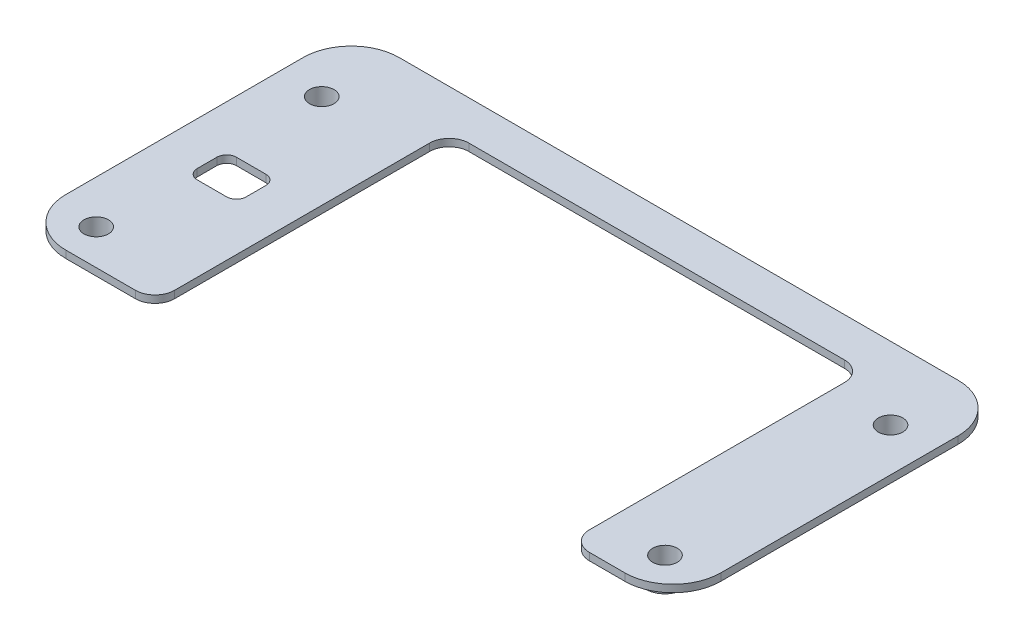
ISO-10303-21;
HEADER;
FILE_DESCRIPTION(('STEP AP214'),'2;1');
FILE_NAME('part.step','',(''),(''),'','','');
FILE_SCHEMA(('AUTOMOTIVE_DESIGN { 1 0 10303 214 1 1 1 1 }'));
ENDSEC;
DATA;
#1=APPLICATION_CONTEXT('core data for automotive mechanical design processes');
#2=APPLICATION_PROTOCOL_DEFINITION('international standard','automotive_design',2000,#1);
#3=PRODUCT_CONTEXT('',#1,'mechanical');
#4=PRODUCT('Part','Part','',(#3));
#5=PRODUCT_RELATED_PRODUCT_CATEGORY('part','',(#4));
#6=PRODUCT_DEFINITION_FORMATION('','',#4);
#7=PRODUCT_DEFINITION_CONTEXT('part definition',#1,'design');
#8=PRODUCT_DEFINITION('design','',#6,#7);
#9=PRODUCT_DEFINITION_SHAPE('','',#8);
#10=(LENGTH_UNIT() NAMED_UNIT(*) SI_UNIT(.MILLI.,.METRE.));
#11=(NAMED_UNIT(*) PLANE_ANGLE_UNIT() SI_UNIT($,.RADIAN.));
#12=(NAMED_UNIT(*) SI_UNIT($,.STERADIAN.) SOLID_ANGLE_UNIT());
#13=UNCERTAINTY_MEASURE_WITH_UNIT(LENGTH_MEASURE(1.E-05),#10,'distance_accuracy_value','');
#14=(GEOMETRIC_REPRESENTATION_CONTEXT(3) GLOBAL_UNCERTAINTY_ASSIGNED_CONTEXT((#13)) GLOBAL_UNIT_ASSIGNED_CONTEXT((#10,
#11,#12)) REPRESENTATION_CONTEXT('',''));
#15=CARTESIAN_POINT('',(0.,0.,0.));
#16=DIRECTION('',(0.,0.,1.));
#17=DIRECTION('',(1.,0.,0.));
#18=AXIS2_PLACEMENT_3D('',#15,#16,#17);
#19=CARTESIAN_POINT('',(20.2165568050337,0.75,15.665));
#20=DIRECTION('',(0.,0.,-1.));
#21=DIRECTION('',(-1.,0.,0.));
#22=AXIS2_PLACEMENT_3D('',#19,#20,#21);
#23=PLANE('',#22);
#24=DIRECTION('',(1.,0.,0.));
#25=VECTOR('',#24,1.);
#26=CARTESIAN_POINT('',(20.2165568050337,0.,15.665));
#27=LINE('',#26,#25);
#28=CARTESIAN_POINT('',(-28.2834431949663,0.,15.665));
#29=VERTEX_POINT('',#28);
#30=CARTESIAN_POINT('',(-21.1834431949663,0.,15.665));
#31=VERTEX_POINT('',#30);
#32=EDGE_CURVE('E346',#29,#31,#27,.T.);
#33=ORIENTED_EDGE('',*,*,#32,.T.);
#34=DIRECTION('',(0.,1.,0.));
#35=VECTOR('',#34,1.);
#36=CARTESIAN_POINT('',(-21.1834431949663,0.75,15.665));
#37=LINE('',#36,#35);
#38=CARTESIAN_POINT('',(-21.1834431949663,0.75,15.665));
#39=VERTEX_POINT('',#38);
#40=EDGE_CURVE('E421',#31,#39,#37,.T.);
#41=ORIENTED_EDGE('',*,*,#40,.T.);
#42=DIRECTION('',(1.,0.,0.));
#43=VECTOR('',#42,1.);
#44=CARTESIAN_POINT('',(-28.2834431949663,0.75,15.665));
#45=LINE('',#44,#43);
#46=CARTESIAN_POINT('',(-28.2834431949663,0.75,15.665));
#47=VERTEX_POINT('',#46);
#48=EDGE_CURVE('E326',#47,#39,#45,.T.);
#49=ORIENTED_EDGE('',*,*,#48,.F.);
#50=DIRECTION('',(0.,-1.,0.));
#51=VECTOR('',#50,1.);
#52=CARTESIAN_POINT('',(-28.2834431949663,0.75,15.665));
#53=LINE('',#52,#51);
#54=EDGE_CURVE('E360',#47,#29,#53,.T.);
#55=ORIENTED_EDGE('',*,*,#54,.T.);
#56=EDGE_LOOP('',(#33,#41,#49,#55));
#57=FACE_BOUND('',#56,.T.);
#58=ADVANCED_FACE('F39',(#57),#23,.F.);
#59=CARTESIAN_POINT('',(28.7165568050337,0.75,-13.435));
#60=DIRECTION('',(0.,-1.,0.));
#61=DIRECTION('',(0.,0.,-1.));
#62=AXIS2_PLACEMENT_3D('',#59,#60,#61);
#63=CYLINDRICAL_SURFACE('',#62,4.9);
#64=CARTESIAN_POINT('',(28.7165568050337,0.,-13.435));
#65=DIRECTION('',(0.,1.,0.));
#66=DIRECTION('',(0.,0.,1.));
#67=AXIS2_PLACEMENT_3D('',#64,#65,#66);
#68=CIRCLE('',#67,4.9);
#69=CARTESIAN_POINT('',(33.6165568050337,0.,-13.435));
#70=VERTEX_POINT('',#69);
#71=CARTESIAN_POINT('',(28.7165568050337,0.,-18.335));
#72=VERTEX_POINT('',#71);
#73=EDGE_CURVE('E312',#70,#72,#68,.T.);
#74=ORIENTED_EDGE('',*,*,#73,.T.);
#75=DIRECTION('',(0.,-1.,0.));
#76=VECTOR('',#75,1.);
#77=CARTESIAN_POINT('',(28.7165568050337,0.75,-18.335));
#78=LINE('',#77,#76);
#79=CARTESIAN_POINT('',(28.7165568050337,0.75,-18.335));
#80=VERTEX_POINT('',#79);
#81=EDGE_CURVE('E372',#80,#72,#78,.T.);
#82=ORIENTED_EDGE('',*,*,#81,.F.);
#83=CARTESIAN_POINT('',(28.7165568050337,0.75,-13.435));
#84=DIRECTION('',(0.,1.,0.));
#85=DIRECTION('',(0.,0.,1.));
#86=AXIS2_PLACEMENT_3D('',#83,#84,#85);
#87=CIRCLE('',#86,4.9);
#88=CARTESIAN_POINT('',(33.6165568050337,0.75,-13.435));
#89=VERTEX_POINT('',#88);
#90=EDGE_CURVE('E313',#89,#80,#87,.T.);
#91=ORIENTED_EDGE('',*,*,#90,.F.);
#92=DIRECTION('',(0.,-1.,0.));
#93=VECTOR('',#92,1.);
#94=CARTESIAN_POINT('',(33.6165568050337,0.75,-13.435));
#95=LINE('',#94,#93);
#96=EDGE_CURVE('E333',#89,#70,#95,.T.);
#97=ORIENTED_EDGE('',*,*,#96,.T.);
#98=EDGE_LOOP('',(#74,#82,#91,#97));
#99=FACE_BOUND('',#98,.T.);
#100=ADVANCED_FACE('F475',(#99),#63,.T.);
#101=CARTESIAN_POINT('',(-28.2834431949663,0.75,-18.335));
#102=DIRECTION('',(0.,0.,1.));
#103=DIRECTION('',(1.,0.,0.));
#104=AXIS2_PLACEMENT_3D('',#101,#102,#103);
#105=PLANE('',#104);
#106=DIRECTION('',(-1.,0.,0.));
#107=VECTOR('',#106,1.);
#108=CARTESIAN_POINT('',(-28.2834431949663,0.,-18.335));
#109=LINE('',#108,#107);
#110=CARTESIAN_POINT('',(-28.2834431949663,0.,-18.335));
#111=VERTEX_POINT('',#110);
#112=EDGE_CURVE('E336',#72,#111,#109,.T.);
#113=ORIENTED_EDGE('',*,*,#112,.T.);
#114=DIRECTION('',(0.,-1.,0.));
#115=VECTOR('',#114,1.);
#116=CARTESIAN_POINT('',(-28.2834431949663,0.75,-18.335));
#117=LINE('',#116,#115);
#118=CARTESIAN_POINT('',(-28.2834431949663,0.75,-18.335));
#119=VERTEX_POINT('',#118);
#120=EDGE_CURVE('E369',#119,#111,#117,.T.);
#121=ORIENTED_EDGE('',*,*,#120,.F.);
#122=DIRECTION('',(-1.,0.,0.));
#123=VECTOR('',#122,1.);
#124=CARTESIAN_POINT('',(-28.2834431949663,0.75,-18.335));
#125=LINE('',#124,#123);
#126=EDGE_CURVE('E316',#80,#119,#125,.T.);
#127=ORIENTED_EDGE('',*,*,#126,.F.);
#128=ORIENTED_EDGE('',*,*,#81,.T.);
#129=EDGE_LOOP('',(#113,#121,#127,#128));
#130=FACE_BOUND('',#129,.T.);
#131=ADVANCED_FACE('F469',(#130),#105,.F.);
#132=CARTESIAN_POINT('',(-28.2834431949663,0.75,-13.435));
#133=DIRECTION('',(0.,-1.,0.));
#134=DIRECTION('',(0.,0.,-1.));
#135=AXIS2_PLACEMENT_3D('',#132,#133,#134);
#136=CYLINDRICAL_SURFACE('',#135,4.9);
#137=CARTESIAN_POINT('',(-28.2834431949663,0.,-13.435));
#138=DIRECTION('',(0.,1.,0.));
#139=DIRECTION('',(0.,0.,-1.));
#140=AXIS2_PLACEMENT_3D('',#137,#138,#139);
#141=CIRCLE('',#140,4.9);
#142=CARTESIAN_POINT('',(-33.1834431949663,0.,-13.435));
#143=VERTEX_POINT('',#142);
#144=EDGE_CURVE('E338',#111,#143,#141,.T.);
#145=ORIENTED_EDGE('',*,*,#144,.T.);
#146=DIRECTION('',(0.,-1.,0.));
#147=VECTOR('',#146,1.);
#148=CARTESIAN_POINT('',(-33.1834431949663,0.75,-13.435));
#149=LINE('',#148,#147);
#150=CARTESIAN_POINT('',(-33.1834431949663,0.75,-13.435));
#151=VERTEX_POINT('',#150);
#152=EDGE_CURVE('E366',#151,#143,#149,.T.);
#153=ORIENTED_EDGE('',*,*,#152,.F.);
#154=CARTESIAN_POINT('',(-28.2834431949663,0.75,-13.435));
#155=DIRECTION('',(0.,1.,0.));
#156=DIRECTION('',(0.,0.,-1.));
#157=AXIS2_PLACEMENT_3D('',#154,#155,#156);
#158=CIRCLE('',#157,4.9);
#159=EDGE_CURVE('E319',#119,#151,#158,.T.);
#160=ORIENTED_EDGE('',*,*,#159,.F.);
#161=ORIENTED_EDGE('',*,*,#120,.T.);
#162=EDGE_LOOP('',(#145,#153,#160,#161));
#163=FACE_BOUND('',#162,.T.);
#164=ADVANCED_FACE('F466',(#163),#136,.T.);
#165=CARTESIAN_POINT('',(-33.1834431949663,0.75,-13.435));
#166=DIRECTION('',(1.,0.,0.));
#167=DIRECTION('',(0.,0.,-1.));
#168=AXIS2_PLACEMENT_3D('',#165,#166,#167);
#169=PLANE('',#168);
#170=DIRECTION('',(0.,0.,1.));
#171=VECTOR('',#170,1.);
#172=CARTESIAN_POINT('',(-33.1834431949663,0.,-13.435));
#173=LINE('',#172,#171);
#174=CARTESIAN_POINT('',(-33.1834431949663,0.,10.765));
#175=VERTEX_POINT('',#174);
#176=EDGE_CURVE('E340',#143,#175,#173,.T.);
#177=ORIENTED_EDGE('',*,*,#176,.T.);
#178=DIRECTION('',(0.,-1.,0.));
#179=VECTOR('',#178,1.);
#180=CARTESIAN_POINT('',(-33.1834431949663,0.75,10.765));
#181=LINE('',#180,#179);
#182=CARTESIAN_POINT('',(-33.1834431949663,0.75,10.765));
#183=VERTEX_POINT('',#182);
#184=EDGE_CURVE('E363',#183,#175,#181,.T.);
#185=ORIENTED_EDGE('',*,*,#184,.F.);
#186=DIRECTION('',(0.,0.,1.));
#187=VECTOR('',#186,1.);
#188=CARTESIAN_POINT('',(-33.1834431949663,0.75,-13.435));
#189=LINE('',#188,#187);
#190=EDGE_CURVE('E321',#151,#183,#189,.T.);
#191=ORIENTED_EDGE('',*,*,#190,.F.);
#192=ORIENTED_EDGE('',*,*,#152,.T.);
#193=EDGE_LOOP('',(#177,#185,#191,#192));
#194=FACE_BOUND('',#193,.T.);
#195=ADVANCED_FACE('F461',(#194),#169,.F.);
#196=CARTESIAN_POINT('',(-28.2834431949663,0.75,10.765));
#197=DIRECTION('',(0.,-1.,0.));
#198=DIRECTION('',(0.,0.,-1.));
#199=AXIS2_PLACEMENT_3D('',#196,#197,#198);
#200=CYLINDRICAL_SURFACE('',#199,4.9);
#201=CARTESIAN_POINT('',(-28.2834431949663,0.,10.765));
#202=DIRECTION('',(0.,1.,0.));
#203=DIRECTION('',(0.,0.,1.));
#204=AXIS2_PLACEMENT_3D('',#201,#202,#203);
#205=CIRCLE('',#204,4.9);
#206=EDGE_CURVE('E342',#175,#29,#205,.T.);
#207=ORIENTED_EDGE('',*,*,#206,.T.);
#208=ORIENTED_EDGE('',*,*,#54,.F.);
#209=CARTESIAN_POINT('',(-28.2834431949663,0.75,10.765));
#210=DIRECTION('',(0.,1.,0.));
#211=DIRECTION('',(0.,0.,1.));
#212=AXIS2_PLACEMENT_3D('',#209,#210,#211);
#213=CIRCLE('',#212,4.9);
#214=EDGE_CURVE('E323',#183,#47,#213,.T.);
#215=ORIENTED_EDGE('',*,*,#214,.F.);
#216=ORIENTED_EDGE('',*,*,#184,.T.);
#217=EDGE_LOOP('',(#207,#208,#215,#216));
#218=FACE_BOUND('',#217,.T.);
#219=ADVANCED_FACE('F456',(#218),#200,.T.);
#220=CARTESIAN_POINT('',(25.1165568050337,0.75,15.665));
#221=VERTEX_POINT('',#220);
#222=CARTESIAN_POINT('',(28.7165568050337,0.75,15.665));
#223=VERTEX_POINT('',#222);
#224=EDGE_CURVE('E325',#221,#223,#45,.T.);
#225=ORIENTED_EDGE('',*,*,#224,.F.);
#226=DIRECTION('',(0.,1.,0.));
#227=VECTOR('',#226,1.);
#228=CARTESIAN_POINT('',(25.1165568050337,0.75,15.665));
#229=LINE('',#228,#227);
#230=CARTESIAN_POINT('',(25.1165568050337,0.,15.665));
#231=VERTEX_POINT('',#230);
#232=EDGE_CURVE('E405',#221,#231,#229,.F.);
#233=ORIENTED_EDGE('',*,*,#232,.T.);
#234=CARTESIAN_POINT('',(28.7165568050337,0.,15.665));
#235=VERTEX_POINT('',#234);
#236=EDGE_CURVE('E345',#231,#235,#27,.T.);
#237=ORIENTED_EDGE('',*,*,#236,.T.);
#238=DIRECTION('',(0.,-1.,0.));
#239=VECTOR('',#238,1.);
#240=CARTESIAN_POINT('',(28.7165568050337,0.75,15.665));
#241=LINE('',#240,#239);
#242=EDGE_CURVE('E357',#223,#235,#241,.T.);
#243=ORIENTED_EDGE('',*,*,#242,.F.);
#244=EDGE_LOOP('',(#225,#233,#237,#243));
#245=FACE_BOUND('',#244,.T.);
#246=ADVANCED_FACE('F509',(#245),#23,.F.);
#247=CARTESIAN_POINT('',(28.7165568050337,0.75,10.765));
#248=DIRECTION('',(0.,-1.,0.));
#249=DIRECTION('',(0.,0.,-1.));
#250=AXIS2_PLACEMENT_3D('',#247,#248,#249);
#251=CYLINDRICAL_SURFACE('',#250,4.9);
#252=CARTESIAN_POINT('',(28.7165568050337,0.,10.765));
#253=DIRECTION('',(0.,1.,0.));
#254=DIRECTION('',(0.,0.,1.));
#255=AXIS2_PLACEMENT_3D('',#252,#253,#254);
#256=CIRCLE('',#255,4.9);
#257=CARTESIAN_POINT('',(33.6165568050337,0.,10.765));
#258=VERTEX_POINT('',#257);
#259=EDGE_CURVE('E349',#235,#258,#256,.T.);
#260=ORIENTED_EDGE('',*,*,#259,.T.);
#261=DIRECTION('',(0.,-1.,0.));
#262=VECTOR('',#261,1.);
#263=CARTESIAN_POINT('',(33.6165568050337,0.75,10.765));
#264=LINE('',#263,#262);
#265=CARTESIAN_POINT('',(33.6165568050337,0.75,10.765));
#266=VERTEX_POINT('',#265);
#267=EDGE_CURVE('E354',#266,#258,#264,.T.);
#268=ORIENTED_EDGE('',*,*,#267,.F.);
#269=CARTESIAN_POINT('',(28.7165568050337,0.75,10.765));
#270=DIRECTION('',(0.,1.,0.));
#271=DIRECTION('',(0.,0.,1.));
#272=AXIS2_PLACEMENT_3D('',#269,#270,#271);
#273=CIRCLE('',#272,4.9);
#274=EDGE_CURVE('E329',#223,#266,#273,.T.);
#275=ORIENTED_EDGE('',*,*,#274,.F.);
#276=ORIENTED_EDGE('',*,*,#242,.T.);
#277=EDGE_LOOP('',(#260,#268,#275,#276));
#278=FACE_BOUND('',#277,.T.);
#279=ADVANCED_FACE('F484',(#278),#251,.T.);
#280=CARTESIAN_POINT('',(33.6165568050337,0.75,10.765));
#281=DIRECTION('',(-1.,0.,0.));
#282=DIRECTION('',(0.,0.,1.));
#283=AXIS2_PLACEMENT_3D('',#280,#281,#282);
#284=PLANE('',#283);
#285=DIRECTION('',(0.,0.,-1.));
#286=VECTOR('',#285,1.);
#287=CARTESIAN_POINT('',(33.6165568050337,0.,10.765));
#288=LINE('',#287,#286);
#289=EDGE_CURVE('E317',#258,#70,#288,.T.);
#290=ORIENTED_EDGE('',*,*,#289,.T.);
#291=ORIENTED_EDGE('',*,*,#96,.F.);
#292=DIRECTION('',(0.,0.,-1.));
#293=VECTOR('',#292,1.);
#294=CARTESIAN_POINT('',(33.6165568050337,0.75,10.765));
#295=LINE('',#294,#293);
#296=EDGE_CURVE('E331',#266,#89,#295,.T.);
#297=ORIENTED_EDGE('',*,*,#296,.F.);
#298=ORIENTED_EDGE('',*,*,#267,.T.);
#299=EDGE_LOOP('',(#290,#291,#297,#298));
#300=FACE_BOUND('',#299,.T.);
#301=ADVANCED_FACE('F480',(#300),#284,.F.);
#302=CARTESIAN_POINT('',(28.7165568050337,0.75,-13.435));
#303=DIRECTION('',(0.,1.,0.));
#304=DIRECTION('',(0.,0.,1.));
#305=AXIS2_PLACEMENT_3D('',#302,#303,#304);
#306=PLANE('',#305);
#307=CARTESIAN_POINT('',(-24.7834431949663,0.75,1.765));
#308=DIRECTION('',(0.,-1.,0.));
#309=DIRECTION('',(0.,0.,1.));
#310=AXIS2_PLACEMENT_3D('',#307,#308,#309);
#311=CIRCLE('',#310,1.);
#312=CARTESIAN_POINT('',(-23.7834431949663,0.75,1.76499999999999));
#313=VERTEX_POINT('',#312);
#314=CARTESIAN_POINT('',(-24.7834431949663,0.75,2.765));
#315=VERTEX_POINT('',#314);
#316=EDGE_CURVE('E201',#313,#315,#311,.T.);
#317=ORIENTED_EDGE('',*,*,#316,.T.);
#318=DIRECTION('',(-1.,0.,0.));
#319=VECTOR('',#318,1.);
#320=CARTESIAN_POINT('',(-27.7834431949663,0.75,2.765));
#321=LINE('',#320,#319);
#322=CARTESIAN_POINT('',(-27.7834431949663,0.75,2.765));
#323=VERTEX_POINT('',#322);
#324=EDGE_CURVE('E210',#315,#323,#321,.T.);
#325=ORIENTED_EDGE('',*,*,#324,.T.);
#326=CARTESIAN_POINT('',(-27.7834431949663,0.75,1.765));
#327=DIRECTION('',(0.,-1.,0.));
#328=DIRECTION('',(0.,0.,-1.));
#329=AXIS2_PLACEMENT_3D('',#326,#327,#328);
#330=CIRCLE('',#329,1.);
#331=CARTESIAN_POINT('',(-28.7834431949663,0.75,1.76499999999999));
#332=VERTEX_POINT('',#331);
#333=EDGE_CURVE('E54',#323,#332,#330,.T.);
#334=ORIENTED_EDGE('',*,*,#333,.T.);
#335=DIRECTION('',(0.,0.,-1.));
#336=VECTOR('',#335,1.);
#337=CARTESIAN_POINT('',(-28.7834431949663,0.75,1.76499999999999));
#338=LINE('',#337,#336);
#339=CARTESIAN_POINT('',(-28.7834431949663,0.75,-0.234999999999995));
#340=VERTEX_POINT('',#339);
#341=EDGE_CURVE('E225',#332,#340,#338,.T.);
#342=ORIENTED_EDGE('',*,*,#341,.T.);
#343=CARTESIAN_POINT('',(-27.7834431949663,0.75,-0.235000000000002));
#344=DIRECTION('',(0.,-1.,0.));
#345=DIRECTION('',(0.,0.,-1.));
#346=AXIS2_PLACEMENT_3D('',#343,#344,#345);
#347=CIRCLE('',#346,1.);
#348=CARTESIAN_POINT('',(-27.7834431949663,0.75,-1.235));
#349=VERTEX_POINT('',#348);
#350=EDGE_CURVE('E228',#340,#349,#347,.T.);
#351=ORIENTED_EDGE('',*,*,#350,.T.);
#352=DIRECTION('',(1.,0.,0.));
#353=VECTOR('',#352,1.);
#354=CARTESIAN_POINT('',(-27.7834431949663,0.75,-1.235));
#355=LINE('',#354,#353);
#356=CARTESIAN_POINT('',(-24.7834431949663,0.75,-1.235));
#357=VERTEX_POINT('',#356);
#358=EDGE_CURVE('E231',#349,#357,#355,.T.);
#359=ORIENTED_EDGE('',*,*,#358,.T.);
#360=CARTESIAN_POINT('',(-24.7834431949663,0.75,-0.235000000000002));
#361=DIRECTION('',(0.,-1.,0.));
#362=DIRECTION('',(0.,0.,-1.));
#363=AXIS2_PLACEMENT_3D('',#360,#361,#362);
#364=CIRCLE('',#363,1.);
#365=CARTESIAN_POINT('',(-23.7834431949663,0.75,-0.234999999999995));
#366=VERTEX_POINT('',#365);
#367=EDGE_CURVE('E234',#357,#366,#364,.T.);
#368=ORIENTED_EDGE('',*,*,#367,.T.);
#369=DIRECTION('',(0.,0.,1.));
#370=VECTOR('',#369,1.);
#371=CARTESIAN_POINT('',(-23.7834431949663,0.75,1.76499999999999));
#372=LINE('',#371,#370);
#373=EDGE_CURVE('E207',#366,#313,#372,.T.);
#374=ORIENTED_EDGE('',*,*,#373,.T.);
#375=EDGE_LOOP('',(#317,#325,#334,#342,#351,#359,#368,#374));
#376=FACE_BOUND('',#375,.T.);
#377=DIRECTION('',(0.,0.,-1.));
#378=VECTOR('',#377,1.);
#379=CARTESIAN_POINT('',(23.1165568050337,0.75,15.665));
#380=LINE('',#379,#378);
#381=CARTESIAN_POINT('',(23.1165568050337,0.75,13.665));
#382=VERTEX_POINT('',#381);
#383=CARTESIAN_POINT('',(23.1165568050337,0.75,-12.335));
#384=VERTEX_POINT('',#383);
#385=EDGE_CURVE('E270',#382,#384,#380,.T.);
#386=ORIENTED_EDGE('',*,*,#385,.F.);
#387=CARTESIAN_POINT('',(25.1165568050337,0.75,13.665));
#388=DIRECTION('',(0.,1.,0.));
#389=DIRECTION('',(0.,0.,1.));
#390=AXIS2_PLACEMENT_3D('',#387,#388,#389);
#391=CIRCLE('',#390,2.);
#392=EDGE_CURVE('E403',#382,#221,#391,.T.);
#393=ORIENTED_EDGE('',*,*,#392,.T.);
#394=ORIENTED_EDGE('',*,*,#224,.T.);
#395=ORIENTED_EDGE('',*,*,#274,.T.);
#396=ORIENTED_EDGE('',*,*,#296,.T.);
#397=ORIENTED_EDGE('',*,*,#90,.T.);
#398=ORIENTED_EDGE('',*,*,#126,.T.);
#399=ORIENTED_EDGE('',*,*,#159,.T.);
#400=ORIENTED_EDGE('',*,*,#190,.T.);
#401=ORIENTED_EDGE('',*,*,#214,.T.);
#402=ORIENTED_EDGE('',*,*,#48,.T.);
#403=CARTESIAN_POINT('',(-21.1834431949663,0.75,13.665));
#404=DIRECTION('',(0.,1.,0.));
#405=DIRECTION('',(0.,0.,1.));
#406=AXIS2_PLACEMENT_3D('',#403,#404,#405);
#407=CIRCLE('',#406,2.);
#408=CARTESIAN_POINT('',(-19.1834431949663,0.75,13.665));
#409=VERTEX_POINT('',#408);
#410=EDGE_CURVE('E401',#39,#409,#407,.T.);
#411=ORIENTED_EDGE('',*,*,#410,.T.);
#412=DIRECTION('',(0.,0.,1.));
#413=VECTOR('',#412,1.);
#414=CARTESIAN_POINT('',(-19.1834431949663,0.75,15.665));
#415=LINE('',#414,#413);
#416=CARTESIAN_POINT('',(-19.1834431949663,0.75,-12.335));
#417=VERTEX_POINT('',#416);
#418=EDGE_CURVE('E256',#417,#409,#415,.T.);
#419=ORIENTED_EDGE('',*,*,#418,.F.);
#420=CARTESIAN_POINT('',(-17.1834431949663,0.75,-12.335));
#421=DIRECTION('',(0.,1.,0.));
#422=DIRECTION('',(0.,0.,1.));
#423=AXIS2_PLACEMENT_3D('',#420,#421,#422);
#424=CIRCLE('',#423,2.);
#425=CARTESIAN_POINT('',(-17.1834431949663,0.75,-14.335));
#426=VERTEX_POINT('',#425);
#427=EDGE_CURVE('E47',#417,#426,#424,.F.);
#428=ORIENTED_EDGE('',*,*,#427,.T.);
#429=DIRECTION('',(-1.,0.,0.));
#430=VECTOR('',#429,1.);
#431=CARTESIAN_POINT('',(-19.1834431949663,0.75,-14.335));
#432=LINE('',#431,#430);
#433=CARTESIAN_POINT('',(21.1165568050337,0.75,-14.335));
#434=VERTEX_POINT('',#433);
#435=EDGE_CURVE('E273',#434,#426,#432,.T.);
#436=ORIENTED_EDGE('',*,*,#435,.F.);
#437=CARTESIAN_POINT('',(21.1165568050337,0.75,-12.335));
#438=DIRECTION('',(0.,1.,0.));
#439=DIRECTION('',(0.,0.,1.));
#440=AXIS2_PLACEMENT_3D('',#437,#438,#439);
#441=CIRCLE('',#440,2.);
#442=EDGE_CURVE('E424',#434,#384,#441,.F.);
#443=ORIENTED_EDGE('',*,*,#442,.T.);
#444=EDGE_LOOP('',(#386,#393,#394,#395,#396,#397,#398,#399,#400,#401,#402,#411,#419,#428,#436,#443));
#445=FACE_BOUND('',#444,.T.);
#446=CARTESIAN_POINT('',(29.2165568050337,0.75,12.065));
#447=DIRECTION('',(0.,-1.,0.));
#448=DIRECTION('',(0.,0.,-1.));
#449=AXIS2_PLACEMENT_3D('',#446,#447,#448);
#450=CIRCLE('',#449,1.25);
#451=CARTESIAN_POINT('',(29.2165568050337,0.75,10.815));
#452=VERTEX_POINT('',#451);
#453=EDGE_CURVE('E276',#452,#452,#450,.T.);
#454=ORIENTED_EDGE('',*,*,#453,.T.);
#455=EDGE_LOOP('',(#454));
#456=FACE_BOUND('',#455,.T.);
#457=CARTESIAN_POINT('',(29.2165568050337,0.75,-10.935));
#458=DIRECTION('',(0.,-1.,0.));
#459=DIRECTION('',(0.,0.,-1.));
#460=AXIS2_PLACEMENT_3D('',#457,#458,#459);
#461=CIRCLE('',#460,1.25);
#462=CARTESIAN_POINT('',(29.2165568050337,0.75,-12.185));
#463=VERTEX_POINT('',#462);
#464=EDGE_CURVE('E287',#463,#463,#461,.T.);
#465=ORIENTED_EDGE('',*,*,#464,.T.);
#466=EDGE_LOOP('',(#465));
#467=FACE_BOUND('',#466,.T.);
#468=CARTESIAN_POINT('',(-28.7834431949663,0.75,-10.935));
#469=DIRECTION('',(0.,-1.,0.));
#470=DIRECTION('',(0.,0.,-1.));
#471=AXIS2_PLACEMENT_3D('',#468,#469,#470);
#472=CIRCLE('',#471,1.25);
#473=CARTESIAN_POINT('',(-28.7834431949663,0.75,-12.185));
#474=VERTEX_POINT('',#473);
#475=EDGE_CURVE('E281',#474,#474,#472,.T.);
#476=ORIENTED_EDGE('',*,*,#475,.T.);
#477=EDGE_LOOP('',(#476));
#478=FACE_BOUND('',#477,.T.);
#479=CARTESIAN_POINT('',(-28.7834431949663,0.75,12.065));
#480=DIRECTION('',(0.,-1.,0.));
#481=DIRECTION('',(0.,0.,-1.));
#482=AXIS2_PLACEMENT_3D('',#479,#480,#481);
#483=CIRCLE('',#482,1.25);
#484=CARTESIAN_POINT('',(-28.7834431949663,0.75,10.815));
#485=VERTEX_POINT('',#484);
#486=EDGE_CURVE('E295',#485,#485,#483,.T.);
#487=ORIENTED_EDGE('',*,*,#486,.T.);
#488=EDGE_LOOP('',(#487));
#489=FACE_BOUND('',#488,.T.);
#490=ADVANCED_FACE('F214',(#376,#445,#456,#467,#478,#489),#306,.T.);
#491=CARTESIAN_POINT('',(28.7165568050337,0.,-13.435));
#492=DIRECTION('',(0.,1.,0.));
#493=DIRECTION('',(0.,0.,1.));
#494=AXIS2_PLACEMENT_3D('',#491,#492,#493);
#495=PLANE('',#494);
#496=DIRECTION('',(-1.,0.,0.));
#497=VECTOR('',#496,1.);
#498=CARTESIAN_POINT('',(-27.7834431949663,0.,2.765));
#499=LINE('',#498,#497);
#500=CARTESIAN_POINT('',(-24.7834431949663,0.,2.765));
#501=VERTEX_POINT('',#500);
#502=CARTESIAN_POINT('',(-27.7834431949663,0.,2.765));
#503=VERTEX_POINT('',#502);
#504=EDGE_CURVE('E238',#501,#503,#499,.T.);
#505=ORIENTED_EDGE('',*,*,#504,.F.);
#506=CARTESIAN_POINT('',(-24.7834431949663,0.,1.765));
#507=DIRECTION('',(0.,-1.,0.));
#508=DIRECTION('',(0.,0.,1.));
#509=AXIS2_PLACEMENT_3D('',#506,#507,#508);
#510=CIRCLE('',#509,1.);
#511=CARTESIAN_POINT('',(-23.7834431949663,0.,1.76499999999999));
#512=VERTEX_POINT('',#511);
#513=EDGE_CURVE('E62',#512,#501,#510,.T.);
#514=ORIENTED_EDGE('',*,*,#513,.F.);
#515=DIRECTION('',(0.,0.,1.));
#516=VECTOR('',#515,1.);
#517=CARTESIAN_POINT('',(-23.7834431949663,0.,1.76499999999999));
#518=LINE('',#517,#516);
#519=CARTESIAN_POINT('',(-23.7834431949663,0.,-0.234999999999995));
#520=VERTEX_POINT('',#519);
#521=EDGE_CURVE('E218',#520,#512,#518,.T.);
#522=ORIENTED_EDGE('',*,*,#521,.F.);
#523=CARTESIAN_POINT('',(-24.7834431949663,0.,-0.235000000000002));
#524=DIRECTION('',(0.,-1.,0.));
#525=DIRECTION('',(0.,0.,-1.));
#526=AXIS2_PLACEMENT_3D('',#523,#524,#525);
#527=CIRCLE('',#526,1.);
#528=CARTESIAN_POINT('',(-24.7834431949663,0.,-1.235));
#529=VERTEX_POINT('',#528);
#530=EDGE_CURVE('E221',#529,#520,#527,.T.);
#531=ORIENTED_EDGE('',*,*,#530,.F.);
#532=DIRECTION('',(1.,0.,0.));
#533=VECTOR('',#532,1.);
#534=CARTESIAN_POINT('',(-27.7834431949663,0.,-1.235));
#535=LINE('',#534,#533);
#536=CARTESIAN_POINT('',(-27.7834431949663,0.,-1.235));
#537=VERTEX_POINT('',#536);
#538=EDGE_CURVE('E249',#537,#529,#535,.T.);
#539=ORIENTED_EDGE('',*,*,#538,.F.);
#540=CARTESIAN_POINT('',(-27.7834431949663,0.,-0.235000000000002));
#541=DIRECTION('',(0.,-1.,0.));
#542=DIRECTION('',(0.,0.,-1.));
#543=AXIS2_PLACEMENT_3D('',#540,#541,#542);
#544=CIRCLE('',#543,1.);
#545=CARTESIAN_POINT('',(-28.7834431949663,0.,-0.234999999999995));
#546=VERTEX_POINT('',#545);
#547=EDGE_CURVE('E246',#546,#537,#544,.T.);
#548=ORIENTED_EDGE('',*,*,#547,.F.);
#549=DIRECTION('',(0.,0.,-1.));
#550=VECTOR('',#549,1.);
#551=CARTESIAN_POINT('',(-28.7834431949663,0.,1.76499999999999));
#552=LINE('',#551,#550);
#553=CARTESIAN_POINT('',(-28.7834431949663,0.,1.76499999999999));
#554=VERTEX_POINT('',#553);
#555=EDGE_CURVE('E243',#554,#546,#552,.T.);
#556=ORIENTED_EDGE('',*,*,#555,.F.);
#557=CARTESIAN_POINT('',(-27.7834431949663,0.,1.765));
#558=DIRECTION('',(0.,-1.,0.));
#559=DIRECTION('',(0.,0.,-1.));
#560=AXIS2_PLACEMENT_3D('',#557,#558,#559);
#561=CIRCLE('',#560,1.);
#562=EDGE_CURVE('E240',#503,#554,#561,.T.);
#563=ORIENTED_EDGE('',*,*,#562,.F.);
#564=EDGE_LOOP('',(#505,#514,#522,#531,#539,#548,#556,#563));
#565=FACE_BOUND('',#564,.T.);
#566=CARTESIAN_POINT('',(29.2165568050337,0.,-10.935));
#567=DIRECTION('',(0.,1.,0.));
#568=DIRECTION('',(0.,0.,1.));
#569=AXIS2_PLACEMENT_3D('',#566,#567,#568);
#570=CIRCLE('',#569,2.);
#571=CARTESIAN_POINT('',(29.2165568050337,0.,-8.93500000000003));
#572=VERTEX_POINT('',#571);
#573=EDGE_CURVE('E384',#572,#572,#570,.F.);
#574=ORIENTED_EDGE('',*,*,#573,.F.);
#575=EDGE_LOOP('',(#574));
#576=FACE_BOUND('',#575,.T.);
#577=CARTESIAN_POINT('',(29.2165568050337,0.,12.065));
#578=DIRECTION('',(0.,1.,0.));
#579=DIRECTION('',(0.,0.,1.));
#580=AXIS2_PLACEMENT_3D('',#577,#578,#579);
#581=CIRCLE('',#580,2.);
#582=CARTESIAN_POINT('',(29.2165568050337,0.,14.065));
#583=VERTEX_POINT('',#582);
#584=EDGE_CURVE('E381',#583,#583,#581,.F.);
#585=ORIENTED_EDGE('',*,*,#584,.F.);
#586=EDGE_LOOP('',(#585));
#587=FACE_BOUND('',#586,.T.);
#588=CARTESIAN_POINT('',(-28.7834431949663,0.,-10.935));
#589=DIRECTION('',(0.,1.,0.));
#590=DIRECTION('',(0.,0.,1.));
#591=AXIS2_PLACEMENT_3D('',#588,#589,#590);
#592=CIRCLE('',#591,2.);
#593=CARTESIAN_POINT('',(-28.7834431949663,0.,-8.93500000000002));
#594=VERTEX_POINT('',#593);
#595=EDGE_CURVE('E378',#594,#594,#592,.F.);
#596=ORIENTED_EDGE('',*,*,#595,.F.);
#597=EDGE_LOOP('',(#596));
#598=FACE_BOUND('',#597,.T.);
#599=CARTESIAN_POINT('',(-28.7834431949663,0.,12.065));
#600=DIRECTION('',(0.,1.,0.));
#601=DIRECTION('',(0.,0.,1.));
#602=AXIS2_PLACEMENT_3D('',#599,#600,#601);
#603=CIRCLE('',#602,2.);
#604=CARTESIAN_POINT('',(-28.7834431949663,0.,14.065));
#605=VERTEX_POINT('',#604);
#606=EDGE_CURVE('E375',#605,#605,#603,.F.);
#607=ORIENTED_EDGE('',*,*,#606,.F.);
#608=EDGE_LOOP('',(#607));
#609=FACE_BOUND('',#608,.T.);
#610=ORIENTED_EDGE('',*,*,#236,.F.);
#611=CARTESIAN_POINT('',(25.1165568050337,0.,13.665));
#612=DIRECTION('',(0.,1.,0.));
#613=DIRECTION('',(0.,0.,1.));
#614=AXIS2_PLACEMENT_3D('',#611,#612,#613);
#615=CIRCLE('',#614,2.);
#616=CARTESIAN_POINT('',(23.1165568050337,0.,13.665));
#617=VERTEX_POINT('',#616);
#618=EDGE_CURVE('E409',#231,#617,#615,.F.);
#619=ORIENTED_EDGE('',*,*,#618,.T.);
#620=DIRECTION('',(0.,0.,-1.));
#621=VECTOR('',#620,1.);
#622=CARTESIAN_POINT('',(23.1165568050337,0.,-13.435));
#623=LINE('',#622,#621);
#624=CARTESIAN_POINT('',(23.1165568050337,0.,-12.335));
#625=VERTEX_POINT('',#624);
#626=EDGE_CURVE('E387',#617,#625,#623,.T.);
#627=ORIENTED_EDGE('',*,*,#626,.T.);
#628=CARTESIAN_POINT('',(21.1165568050337,0.,-12.335));
#629=DIRECTION('',(0.,1.,0.));
#630=DIRECTION('',(0.,0.,1.));
#631=AXIS2_PLACEMENT_3D('',#628,#629,#630);
#632=CIRCLE('',#631,2.);
#633=CARTESIAN_POINT('',(21.1165568050337,0.,-14.335));
#634=VERTEX_POINT('',#633);
#635=EDGE_CURVE('E426',#625,#634,#632,.T.);
#636=ORIENTED_EDGE('',*,*,#635,.T.);
#637=DIRECTION('',(-1.,0.,0.));
#638=VECTOR('',#637,1.);
#639=CARTESIAN_POINT('',(28.7165568050337,0.,-14.335));
#640=LINE('',#639,#638);
#641=CARTESIAN_POINT('',(-17.1834431949663,0.,-14.335));
#642=VERTEX_POINT('',#641);
#643=EDGE_CURVE('E390',#634,#642,#640,.T.);
#644=ORIENTED_EDGE('',*,*,#643,.T.);
#645=CARTESIAN_POINT('',(-17.1834431949663,0.,-12.335));
#646=DIRECTION('',(0.,1.,0.));
#647=DIRECTION('',(0.,0.,1.));
#648=AXIS2_PLACEMENT_3D('',#645,#646,#647);
#649=CIRCLE('',#648,2.);
#650=CARTESIAN_POINT('',(-19.1834431949663,0.,-12.335));
#651=VERTEX_POINT('',#650);
#652=EDGE_CURVE('E11',#642,#651,#649,.T.);
#653=ORIENTED_EDGE('',*,*,#652,.T.);
#654=DIRECTION('',(0.,0.,1.));
#655=VECTOR('',#654,1.);
#656=CARTESIAN_POINT('',(-19.1834431949663,0.,-13.435));
#657=LINE('',#656,#655);
#658=CARTESIAN_POINT('',(-19.1834431949663,0.,13.665));
#659=VERTEX_POINT('',#658);
#660=EDGE_CURVE('E393',#651,#659,#657,.T.);
#661=ORIENTED_EDGE('',*,*,#660,.T.);
#662=CARTESIAN_POINT('',(-21.1834431949663,0.,13.665));
#663=DIRECTION('',(0.,1.,0.));
#664=DIRECTION('',(0.,0.,1.));
#665=AXIS2_PLACEMENT_3D('',#662,#663,#664);
#666=CIRCLE('',#665,2.);
#667=EDGE_CURVE('E407',#659,#31,#666,.F.);
#668=ORIENTED_EDGE('',*,*,#667,.T.);
#669=ORIENTED_EDGE('',*,*,#32,.F.);
#670=ORIENTED_EDGE('',*,*,#206,.F.);
#671=ORIENTED_EDGE('',*,*,#176,.F.);
#672=ORIENTED_EDGE('',*,*,#144,.F.);
#673=ORIENTED_EDGE('',*,*,#112,.F.);
#674=ORIENTED_EDGE('',*,*,#73,.F.);
#675=ORIENTED_EDGE('',*,*,#289,.F.);
#676=ORIENTED_EDGE('',*,*,#259,.F.);
#677=EDGE_LOOP('',(#610,#619,#627,#636,#644,#653,#661,#668,#669,#670,#671,#672,#673,#674,#675,#676));
#678=FACE_BOUND('',#677,.T.);
#679=ADVANCED_FACE('F443',(#565,#576,#587,#598,#609,#678),#495,.F.);
#680=CARTESIAN_POINT('',(-28.7834431949663,-1.25,12.065));
#681=DIRECTION('',(0.,1.,0.));
#682=DIRECTION('',(0.,0.,1.));
#683=AXIS2_PLACEMENT_3D('',#680,#681,#682);
#684=CYLINDRICAL_SURFACE('',#683,2.);
#685=CARTESIAN_POINT('',(-28.7834431949663,-1.25,12.065));
#686=DIRECTION('',(0.,-1.,0.));
#687=DIRECTION('',(0.,0.,-1.));
#688=AXIS2_PLACEMENT_3D('',#685,#686,#687);
#689=CIRCLE('',#688,2.);
#690=CARTESIAN_POINT('',(-28.7834431949663,-1.25,10.065));
#691=VERTEX_POINT('',#690);
#692=EDGE_CURVE('E309',#691,#691,#689,.T.);
#693=ORIENTED_EDGE('',*,*,#692,.F.);
#694=EDGE_LOOP('',(#693));
#695=FACE_BOUND('',#694,.T.);
#696=ORIENTED_EDGE('',*,*,#606,.T.);
#697=EDGE_LOOP('',(#696));
#698=FACE_BOUND('',#697,.T.);
#699=ADVANCED_FACE('F572',(#695,#698),#684,.T.);
#700=CARTESIAN_POINT('',(-28.7834431949663,-1.25,12.065));
#701=DIRECTION('',(0.,-1.,0.));
#702=DIRECTION('',(0.,0.,-1.));
#703=AXIS2_PLACEMENT_3D('',#700,#701,#702);
#704=PLANE('',#703);
#705=CARTESIAN_POINT('',(-28.7834431949663,-1.25,12.065));
#706=DIRECTION('',(0.,-1.,0.));
#707=DIRECTION('',(0.,0.,-1.));
#708=AXIS2_PLACEMENT_3D('',#705,#706,#707);
#709=CIRCLE('',#708,1.25);
#710=CARTESIAN_POINT('',(-28.7834431949663,-1.25,10.815));
#711=VERTEX_POINT('',#710);
#712=EDGE_CURVE('E280',#711,#711,#709,.T.);
#713=ORIENTED_EDGE('',*,*,#712,.F.);
#714=EDGE_LOOP('',(#713));
#715=FACE_BOUND('',#714,.T.);
#716=ORIENTED_EDGE('',*,*,#692,.T.);
#717=EDGE_LOOP('',(#716));
#718=FACE_BOUND('',#717,.T.);
#719=ADVANCED_FACE('F577',(#715,#718),#704,.T.);
#720=CARTESIAN_POINT('',(-28.7834431949663,-1.25,-10.935));
#721=DIRECTION('',(0.,1.,0.));
#722=DIRECTION('',(0.,0.,1.));
#723=AXIS2_PLACEMENT_3D('',#720,#721,#722);
#724=CYLINDRICAL_SURFACE('',#723,2.);
#725=CARTESIAN_POINT('',(-28.7834431949663,-1.25,-10.935));
#726=DIRECTION('',(0.,-1.,0.));
#727=DIRECTION('',(0.,0.,-1.));
#728=AXIS2_PLACEMENT_3D('',#725,#726,#727);
#729=CIRCLE('',#728,2.);
#730=CARTESIAN_POINT('',(-28.7834431949663,-1.25,-12.935));
#731=VERTEX_POINT('',#730);
#732=EDGE_CURVE('E306',#731,#731,#729,.T.);
#733=ORIENTED_EDGE('',*,*,#732,.F.);
#734=EDGE_LOOP('',(#733));
#735=FACE_BOUND('',#734,.T.);
#736=ORIENTED_EDGE('',*,*,#595,.T.);
#737=EDGE_LOOP('',(#736));
#738=FACE_BOUND('',#737,.T.);
#739=ADVANCED_FACE('F588',(#735,#738),#724,.T.);
#740=CARTESIAN_POINT('',(-28.7834431949663,-1.25,-10.935));
#741=DIRECTION('',(0.,-1.,0.));
#742=DIRECTION('',(0.,0.,-1.));
#743=AXIS2_PLACEMENT_3D('',#740,#741,#742);
#744=PLANE('',#743);
#745=CARTESIAN_POINT('',(-28.7834431949663,-1.25,-10.935));
#746=DIRECTION('',(0.,-1.,0.));
#747=DIRECTION('',(0.,0.,-1.));
#748=AXIS2_PLACEMENT_3D('',#745,#746,#747);
#749=CIRCLE('',#748,1.25);
#750=CARTESIAN_POINT('',(-28.7834431949663,-1.25,-12.185));
#751=VERTEX_POINT('',#750);
#752=EDGE_CURVE('E277',#751,#751,#749,.T.);
#753=ORIENTED_EDGE('',*,*,#752,.F.);
#754=EDGE_LOOP('',(#753));
#755=FACE_BOUND('',#754,.T.);
#756=ORIENTED_EDGE('',*,*,#732,.T.);
#757=EDGE_LOOP('',(#756));
#758=FACE_BOUND('',#757,.T.);
#759=ADVANCED_FACE('F593',(#755,#758),#744,.T.);
#760=CARTESIAN_POINT('',(29.2165568050337,-1.25,12.065));
#761=DIRECTION('',(0.,1.,0.));
#762=DIRECTION('',(0.,0.,1.));
#763=AXIS2_PLACEMENT_3D('',#760,#761,#762);
#764=CYLINDRICAL_SURFACE('',#763,2.);
#765=CARTESIAN_POINT('',(29.2165568050337,-1.25,12.065));
#766=DIRECTION('',(0.,-1.,0.));
#767=DIRECTION('',(0.,0.,-1.));
#768=AXIS2_PLACEMENT_3D('',#765,#766,#767);
#769=CIRCLE('',#768,2.);
#770=CARTESIAN_POINT('',(29.2165568050337,-1.25,10.065));
#771=VERTEX_POINT('',#770);
#772=EDGE_CURVE('E303',#771,#771,#769,.T.);
#773=ORIENTED_EDGE('',*,*,#772,.F.);
#774=EDGE_LOOP('',(#773));
#775=FACE_BOUND('',#774,.T.);
#776=ORIENTED_EDGE('',*,*,#584,.T.);
#777=EDGE_LOOP('',(#776));
#778=FACE_BOUND('',#777,.T.);
#779=ADVANCED_FACE('F602',(#775,#778),#764,.T.);
#780=CARTESIAN_POINT('',(29.2165568050337,-1.25,12.065));
#781=DIRECTION('',(0.,-1.,0.));
#782=DIRECTION('',(0.,0.,-1.));
#783=AXIS2_PLACEMENT_3D('',#780,#781,#782);
#784=PLANE('',#783);
#785=CARTESIAN_POINT('',(29.2165568050337,-1.25,12.065));
#786=DIRECTION('',(0.,-1.,0.));
#787=DIRECTION('',(0.,0.,-1.));
#788=AXIS2_PLACEMENT_3D('',#785,#786,#787);
#789=CIRCLE('',#788,1.25);
#790=CARTESIAN_POINT('',(29.2165568050337,-1.25,10.815));
#791=VERTEX_POINT('',#790);
#792=EDGE_CURVE('E290',#791,#791,#789,.T.);
#793=ORIENTED_EDGE('',*,*,#792,.F.);
#794=EDGE_LOOP('',(#793));
#795=FACE_BOUND('',#794,.T.);
#796=ORIENTED_EDGE('',*,*,#772,.T.);
#797=EDGE_LOOP('',(#796));
#798=FACE_BOUND('',#797,.T.);
#799=ADVANCED_FACE('F607',(#795,#798),#784,.T.);
#800=CARTESIAN_POINT('',(29.2165568050337,-1.25,-10.935));
#801=DIRECTION('',(0.,1.,0.));
#802=DIRECTION('',(0.,0.,1.));
#803=AXIS2_PLACEMENT_3D('',#800,#801,#802);
#804=CYLINDRICAL_SURFACE('',#803,2.);
#805=CARTESIAN_POINT('',(29.2165568050337,-1.25,-10.935));
#806=DIRECTION('',(0.,-1.,0.));
#807=DIRECTION('',(0.,0.,-1.));
#808=AXIS2_PLACEMENT_3D('',#805,#806,#807);
#809=CIRCLE('',#808,2.);
#810=CARTESIAN_POINT('',(29.2165568050337,-1.25,-12.935));
#811=VERTEX_POINT('',#810);
#812=EDGE_CURVE('E298',#811,#811,#809,.T.);
#813=ORIENTED_EDGE('',*,*,#812,.F.);
#814=EDGE_LOOP('',(#813));
#815=FACE_BOUND('',#814,.T.);
#816=ORIENTED_EDGE('',*,*,#573,.T.);
#817=EDGE_LOOP('',(#816));
#818=FACE_BOUND('',#817,.T.);
#819=ADVANCED_FACE('F616',(#815,#818),#804,.T.);
#820=CARTESIAN_POINT('',(29.2165568050337,-1.25,-10.935));
#821=DIRECTION('',(0.,-1.,0.));
#822=DIRECTION('',(0.,0.,-1.));
#823=AXIS2_PLACEMENT_3D('',#820,#821,#822);
#824=PLANE('',#823);
#825=CARTESIAN_POINT('',(29.2165568050337,-1.25,-10.935));
#826=DIRECTION('',(0.,-1.,0.));
#827=DIRECTION('',(0.,0.,-1.));
#828=AXIS2_PLACEMENT_3D('',#825,#826,#827);
#829=CIRCLE('',#828,1.25);
#830=CARTESIAN_POINT('',(29.2165568050337,-1.25,-12.185));
#831=VERTEX_POINT('',#830);
#832=EDGE_CURVE('E284',#831,#831,#829,.T.);
#833=ORIENTED_EDGE('',*,*,#832,.F.);
#834=EDGE_LOOP('',(#833));
#835=FACE_BOUND('',#834,.T.);
#836=ORIENTED_EDGE('',*,*,#812,.T.);
#837=EDGE_LOOP('',(#836));
#838=FACE_BOUND('',#837,.T.);
#839=ADVANCED_FACE('F621',(#835,#838),#824,.T.);
#840=CARTESIAN_POINT('',(29.2165568050337,0.75,-10.935));
#841=DIRECTION('',(0.,-1.,0.));
#842=DIRECTION('',(0.,0.,-1.));
#843=AXIS2_PLACEMENT_3D('',#840,#841,#842);
#844=CYLINDRICAL_SURFACE('',#843,1.25);
#845=ORIENTED_EDGE('',*,*,#464,.F.);
#846=EDGE_LOOP('',(#845));
#847=FACE_BOUND('',#846,.T.);
#848=ORIENTED_EDGE('',*,*,#832,.T.);
#849=EDGE_LOOP('',(#848));
#850=FACE_BOUND('',#849,.T.);
#851=ADVANCED_FACE('F656',(#847,#850),#844,.F.);
#852=CARTESIAN_POINT('',(29.2165568050337,0.75,12.065));
#853=DIRECTION('',(0.,-1.,0.));
#854=DIRECTION('',(0.,0.,-1.));
#855=AXIS2_PLACEMENT_3D('',#852,#853,#854);
#856=CYLINDRICAL_SURFACE('',#855,1.25);
#857=ORIENTED_EDGE('',*,*,#453,.F.);
#858=EDGE_LOOP('',(#857));
#859=FACE_BOUND('',#858,.T.);
#860=ORIENTED_EDGE('',*,*,#792,.T.);
#861=EDGE_LOOP('',(#860));
#862=FACE_BOUND('',#861,.T.);
#863=ADVANCED_FACE('F667',(#859,#862),#856,.F.);
#864=CARTESIAN_POINT('',(-28.7834431949663,0.75,-10.935));
#865=DIRECTION('',(0.,-1.,0.));
#866=DIRECTION('',(0.,0.,-1.));
#867=AXIS2_PLACEMENT_3D('',#864,#865,#866);
#868=CYLINDRICAL_SURFACE('',#867,1.25);
#869=ORIENTED_EDGE('',*,*,#475,.F.);
#870=EDGE_LOOP('',(#869));
#871=FACE_BOUND('',#870,.T.);
#872=ORIENTED_EDGE('',*,*,#752,.T.);
#873=EDGE_LOOP('',(#872));
#874=FACE_BOUND('',#873,.T.);
#875=ADVANCED_FACE('F678',(#871,#874),#868,.F.);
#876=CARTESIAN_POINT('',(-28.7834431949663,0.75,12.065));
#877=DIRECTION('',(0.,-1.,0.));
#878=DIRECTION('',(0.,0.,-1.));
#879=AXIS2_PLACEMENT_3D('',#876,#877,#878);
#880=CYLINDRICAL_SURFACE('',#879,1.25);
#881=ORIENTED_EDGE('',*,*,#486,.F.);
#882=EDGE_LOOP('',(#881));
#883=FACE_BOUND('',#882,.T.);
#884=ORIENTED_EDGE('',*,*,#712,.T.);
#885=EDGE_LOOP('',(#884));
#886=FACE_BOUND('',#885,.T.);
#887=ADVANCED_FACE('F689',(#883,#886),#880,.F.);
#888=CARTESIAN_POINT('',(-19.1834431949663,-1.25,15.665));
#889=DIRECTION('',(-1.,0.,0.));
#890=DIRECTION('',(0.,0.,1.));
#891=AXIS2_PLACEMENT_3D('',#888,#889,#890);
#892=PLANE('',#891);
#893=ORIENTED_EDGE('',*,*,#660,.F.);
#894=DIRECTION('',(0.,1.,0.));
#895=VECTOR('',#894,1.);
#896=CARTESIAN_POINT('',(-19.1834431949663,0.75,-12.335));
#897=LINE('',#896,#895);
#898=EDGE_CURVE('E418',#651,#417,#897,.T.);
#899=ORIENTED_EDGE('',*,*,#898,.T.);
#900=ORIENTED_EDGE('',*,*,#418,.T.);
#901=DIRECTION('',(0.,1.,0.));
#902=VECTOR('',#901,1.);
#903=CARTESIAN_POINT('',(-19.1834431949663,-1.25,13.665));
#904=LINE('',#903,#902);
#905=EDGE_CURVE('E416',#409,#659,#904,.F.);
#906=ORIENTED_EDGE('',*,*,#905,.T.);
#907=EDGE_LOOP('',(#893,#899,#900,#906));
#908=FACE_BOUND('',#907,.T.);
#909=ADVANCED_FACE('F446',(#908),#892,.F.);
#910=CARTESIAN_POINT('',(-19.1834431949663,-1.25,-14.335));
#911=DIRECTION('',(0.,0.,-1.));
#912=DIRECTION('',(-1.,0.,0.));
#913=AXIS2_PLACEMENT_3D('',#910,#911,#912);
#914=PLANE('',#913);
#915=ORIENTED_EDGE('',*,*,#643,.F.);
#916=DIRECTION('',(0.,1.,0.));
#917=VECTOR('',#916,1.);
#918=CARTESIAN_POINT('',(21.1165568050337,0.75,-14.335));
#919=LINE('',#918,#917);
#920=EDGE_CURVE('E413',#634,#434,#919,.T.);
#921=ORIENTED_EDGE('',*,*,#920,.T.);
#922=ORIENTED_EDGE('',*,*,#435,.T.);
#923=DIRECTION('',(0.,1.,0.));
#924=VECTOR('',#923,1.);
#925=CARTESIAN_POINT('',(-17.1834431949663,0.,-14.335));
#926=LINE('',#925,#924);
#927=EDGE_CURVE('E411',#426,#642,#926,.F.);
#928=ORIENTED_EDGE('',*,*,#927,.T.);
#929=EDGE_LOOP('',(#915,#921,#922,#928));
#930=FACE_BOUND('',#929,.T.);
#931=ADVANCED_FACE('F436',(#930),#914,.F.);
#932=CARTESIAN_POINT('',(23.1165568050337,-1.25,15.665));
#933=DIRECTION('',(1.,0.,0.));
#934=DIRECTION('',(0.,0.,-1.));
#935=AXIS2_PLACEMENT_3D('',#932,#933,#934);
#936=PLANE('',#935);
#937=ORIENTED_EDGE('',*,*,#626,.F.);
#938=DIRECTION('',(0.,1.,0.));
#939=VECTOR('',#938,1.);
#940=CARTESIAN_POINT('',(23.1165568050337,-1.25,13.665));
#941=LINE('',#940,#939);
#942=EDGE_CURVE('E398',#617,#382,#941,.T.);
#943=ORIENTED_EDGE('',*,*,#942,.T.);
#944=ORIENTED_EDGE('',*,*,#385,.T.);
#945=DIRECTION('',(0.,1.,0.));
#946=VECTOR('',#945,1.);
#947=CARTESIAN_POINT('',(23.1165568050337,0.,-12.335));
#948=LINE('',#947,#946);
#949=EDGE_CURVE('E396',#384,#625,#948,.F.);
#950=ORIENTED_EDGE('',*,*,#949,.T.);
#951=EDGE_LOOP('',(#937,#943,#944,#950));
#952=FACE_BOUND('',#951,.T.);
#953=ADVANCED_FACE('F494',(#952),#936,.F.);
#954=CARTESIAN_POINT('',(25.1165568050337,-1.25,13.665));
#955=DIRECTION('',(0.,1.,0.));
#956=DIRECTION('',(0.,0.,1.));
#957=AXIS2_PLACEMENT_3D('',#954,#955,#956);
#958=CYLINDRICAL_SURFACE('',#957,2.);
#959=ORIENTED_EDGE('',*,*,#618,.F.);
#960=ORIENTED_EDGE('',*,*,#232,.F.);
#961=ORIENTED_EDGE('',*,*,#392,.F.);
#962=ORIENTED_EDGE('',*,*,#942,.F.);
#963=EDGE_LOOP('',(#959,#960,#961,#962));
#964=FACE_BOUND('',#963,.T.);
#965=ADVANCED_FACE('F492',(#964),#958,.T.);
#966=CARTESIAN_POINT('',(21.1165568050337,-1.25,-12.335));
#967=DIRECTION('',(0.,-1.,0.));
#968=DIRECTION('',(0.,0.,-1.));
#969=AXIS2_PLACEMENT_3D('',#966,#967,#968);
#970=CYLINDRICAL_SURFACE('',#969,2.);
#971=ORIENTED_EDGE('',*,*,#635,.F.);
#972=ORIENTED_EDGE('',*,*,#949,.F.);
#973=ORIENTED_EDGE('',*,*,#442,.F.);
#974=ORIENTED_EDGE('',*,*,#920,.F.);
#975=EDGE_LOOP('',(#971,#972,#973,#974));
#976=FACE_BOUND('',#975,.T.);
#977=ADVANCED_FACE('F499',(#976),#970,.F.);
#978=CARTESIAN_POINT('',(-17.1834431949663,-1.25,-12.335));
#979=DIRECTION('',(0.,-1.,0.));
#980=DIRECTION('',(0.,0.,-1.));
#981=AXIS2_PLACEMENT_3D('',#978,#979,#980);
#982=CYLINDRICAL_SURFACE('',#981,2.);
#983=ORIENTED_EDGE('',*,*,#652,.F.);
#984=ORIENTED_EDGE('',*,*,#927,.F.);
#985=ORIENTED_EDGE('',*,*,#427,.F.);
#986=ORIENTED_EDGE('',*,*,#898,.F.);
#987=EDGE_LOOP('',(#983,#984,#985,#986));
#988=FACE_BOUND('',#987,.T.);
#989=ADVANCED_FACE('F439',(#988),#982,.F.);
#990=CARTESIAN_POINT('',(-21.1834431949663,0.75,13.665));
#991=DIRECTION('',(0.,1.,0.));
#992=DIRECTION('',(0.,0.,1.));
#993=AXIS2_PLACEMENT_3D('',#990,#991,#992);
#994=CYLINDRICAL_SURFACE('',#993,2.);
#995=ORIENTED_EDGE('',*,*,#667,.F.);
#996=ORIENTED_EDGE('',*,*,#905,.F.);
#997=ORIENTED_EDGE('',*,*,#410,.F.);
#998=ORIENTED_EDGE('',*,*,#40,.F.);
#999=EDGE_LOOP('',(#995,#996,#997,#998));
#1000=FACE_BOUND('',#999,.T.);
#1001=ADVANCED_FACE('F41',(#1000),#994,.T.);
#1002=CARTESIAN_POINT('',(-24.7834431949663,0.75,1.765));
#1003=DIRECTION('',(0.,-1.,0.));
#1004=DIRECTION('',(0.,0.,-1.));
#1005=AXIS2_PLACEMENT_3D('',#1002,#1003,#1004);
#1006=CYLINDRICAL_SURFACE('',#1005,1.);
#1007=ORIENTED_EDGE('',*,*,#513,.T.);
#1008=DIRECTION('',(0.,-1.,0.));
#1009=VECTOR('',#1008,1.);
#1010=CARTESIAN_POINT('',(-24.7834431949663,0.75,2.765));
#1011=LINE('',#1010,#1009);
#1012=EDGE_CURVE('E197',#315,#501,#1011,.T.);
#1013=ORIENTED_EDGE('',*,*,#1012,.F.);
#1014=ORIENTED_EDGE('',*,*,#316,.F.);
#1015=DIRECTION('',(0.,-1.,0.));
#1016=VECTOR('',#1015,1.);
#1017=CARTESIAN_POINT('',(-23.7834431949663,0.75,1.76499999999999));
#1018=LINE('',#1017,#1016);
#1019=EDGE_CURVE('E254',#313,#512,#1018,.T.);
#1020=ORIENTED_EDGE('',*,*,#1019,.T.);
#1021=EDGE_LOOP('',(#1007,#1013,#1014,#1020));
#1022=FACE_BOUND('',#1021,.T.);
#1023=ADVANCED_FACE('F199',(#1022),#1006,.F.);
#1024=CARTESIAN_POINT('',(-23.7834431949663,0.75,1.76499999999999));
#1025=DIRECTION('',(1.,0.,0.));
#1026=DIRECTION('',(0.,0.,-1.));
#1027=AXIS2_PLACEMENT_3D('',#1024,#1025,#1026);
#1028=PLANE('',#1027);
#1029=ORIENTED_EDGE('',*,*,#521,.T.);
#1030=ORIENTED_EDGE('',*,*,#1019,.F.);
#1031=ORIENTED_EDGE('',*,*,#373,.F.);
#1032=DIRECTION('',(0.,-1.,0.));
#1033=VECTOR('',#1032,1.);
#1034=CARTESIAN_POINT('',(-23.7834431949663,0.75,-0.234999999999995));
#1035=LINE('',#1034,#1033);
#1036=EDGE_CURVE('E257',#366,#520,#1035,.T.);
#1037=ORIENTED_EDGE('',*,*,#1036,.T.);
#1038=EDGE_LOOP('',(#1029,#1030,#1031,#1037));
#1039=FACE_BOUND('',#1038,.T.);
#1040=ADVANCED_FACE('F788',(#1039),#1028,.F.);
#1041=CARTESIAN_POINT('',(-24.7834431949663,0.75,-0.235000000000002));
#1042=DIRECTION('',(0.,-1.,0.));
#1043=DIRECTION('',(0.,0.,-1.));
#1044=AXIS2_PLACEMENT_3D('',#1041,#1042,#1043);
#1045=CYLINDRICAL_SURFACE('',#1044,1.);
#1046=ORIENTED_EDGE('',*,*,#530,.T.);
#1047=ORIENTED_EDGE('',*,*,#1036,.F.);
#1048=ORIENTED_EDGE('',*,*,#367,.F.);
#1049=DIRECTION('',(0.,-1.,0.));
#1050=VECTOR('',#1049,1.);
#1051=CARTESIAN_POINT('',(-24.7834431949663,0.75,-1.235));
#1052=LINE('',#1051,#1050);
#1053=EDGE_CURVE('E259',#357,#529,#1052,.T.);
#1054=ORIENTED_EDGE('',*,*,#1053,.T.);
#1055=EDGE_LOOP('',(#1046,#1047,#1048,#1054));
#1056=FACE_BOUND('',#1055,.T.);
#1057=ADVANCED_FACE('F798',(#1056),#1045,.F.);
#1058=CARTESIAN_POINT('',(-27.7834431949663,0.75,-1.235));
#1059=DIRECTION('',(0.,0.,-1.));
#1060=DIRECTION('',(-1.,0.,0.));
#1061=AXIS2_PLACEMENT_3D('',#1058,#1059,#1060);
#1062=PLANE('',#1061);
#1063=ORIENTED_EDGE('',*,*,#538,.T.);
#1064=ORIENTED_EDGE('',*,*,#1053,.F.);
#1065=ORIENTED_EDGE('',*,*,#358,.F.);
#1066=DIRECTION('',(0.,-1.,0.));
#1067=VECTOR('',#1066,1.);
#1068=CARTESIAN_POINT('',(-27.7834431949663,0.75,-1.235));
#1069=LINE('',#1068,#1067);
#1070=EDGE_CURVE('E261',#349,#537,#1069,.T.);
#1071=ORIENTED_EDGE('',*,*,#1070,.T.);
#1072=EDGE_LOOP('',(#1063,#1064,#1065,#1071));
#1073=FACE_BOUND('',#1072,.T.);
#1074=ADVANCED_FACE('F809',(#1073),#1062,.F.);
#1075=CARTESIAN_POINT('',(-27.7834431949663,0.75,-0.235000000000002));
#1076=DIRECTION('',(0.,-1.,0.));
#1077=DIRECTION('',(0.,0.,-1.));
#1078=AXIS2_PLACEMENT_3D('',#1075,#1076,#1077);
#1079=CYLINDRICAL_SURFACE('',#1078,1.);
#1080=ORIENTED_EDGE('',*,*,#547,.T.);
#1081=ORIENTED_EDGE('',*,*,#1070,.F.);
#1082=ORIENTED_EDGE('',*,*,#350,.F.);
#1083=DIRECTION('',(0.,-1.,0.));
#1084=VECTOR('',#1083,1.);
#1085=CARTESIAN_POINT('',(-28.7834431949663,0.75,-0.234999999999995));
#1086=LINE('',#1085,#1084);
#1087=EDGE_CURVE('E263',#340,#546,#1086,.T.);
#1088=ORIENTED_EDGE('',*,*,#1087,.T.);
#1089=EDGE_LOOP('',(#1080,#1081,#1082,#1088));
#1090=FACE_BOUND('',#1089,.T.);
#1091=ADVANCED_FACE('F820',(#1090),#1079,.F.);
#1092=CARTESIAN_POINT('',(-28.7834431949663,0.75,1.76499999999999));
#1093=DIRECTION('',(-1.,0.,0.));
#1094=DIRECTION('',(0.,0.,1.));
#1095=AXIS2_PLACEMENT_3D('',#1092,#1093,#1094);
#1096=PLANE('',#1095);
#1097=ORIENTED_EDGE('',*,*,#555,.T.);
#1098=ORIENTED_EDGE('',*,*,#1087,.F.);
#1099=ORIENTED_EDGE('',*,*,#341,.F.);
#1100=DIRECTION('',(0.,-1.,0.));
#1101=VECTOR('',#1100,1.);
#1102=CARTESIAN_POINT('',(-28.7834431949663,0.75,1.76499999999999));
#1103=LINE('',#1102,#1101);
#1104=EDGE_CURVE('E265',#332,#554,#1103,.T.);
#1105=ORIENTED_EDGE('',*,*,#1104,.T.);
#1106=EDGE_LOOP('',(#1097,#1098,#1099,#1105));
#1107=FACE_BOUND('',#1106,.T.);
#1108=ADVANCED_FACE('F831',(#1107),#1096,.F.);
#1109=CARTESIAN_POINT('',(-27.7834431949663,0.75,1.765));
#1110=DIRECTION('',(0.,-1.,0.));
#1111=DIRECTION('',(0.,0.,-1.));
#1112=AXIS2_PLACEMENT_3D('',#1109,#1110,#1111);
#1113=CYLINDRICAL_SURFACE('',#1112,1.);
#1114=ORIENTED_EDGE('',*,*,#562,.T.);
#1115=ORIENTED_EDGE('',*,*,#1104,.F.);
#1116=ORIENTED_EDGE('',*,*,#333,.F.);
#1117=DIRECTION('',(0.,-1.,0.));
#1118=VECTOR('',#1117,1.);
#1119=CARTESIAN_POINT('',(-27.7834431949663,0.75,2.765));
#1120=LINE('',#1119,#1118);
#1121=EDGE_CURVE('E206',#323,#503,#1120,.T.);
#1122=ORIENTED_EDGE('',*,*,#1121,.T.);
#1123=EDGE_LOOP('',(#1114,#1115,#1116,#1122));
#1124=FACE_BOUND('',#1123,.T.);
#1125=ADVANCED_FACE('F842',(#1124),#1113,.F.);
#1126=CARTESIAN_POINT('',(-27.7834431949663,0.75,2.765));
#1127=DIRECTION('',(0.,0.,1.));
#1128=DIRECTION('',(1.,0.,0.));
#1129=AXIS2_PLACEMENT_3D('',#1126,#1127,#1128);
#1130=PLANE('',#1129);
#1131=ORIENTED_EDGE('',*,*,#504,.T.);
#1132=ORIENTED_EDGE('',*,*,#1121,.F.);
#1133=ORIENTED_EDGE('',*,*,#324,.F.);
#1134=ORIENTED_EDGE('',*,*,#1012,.T.);
#1135=EDGE_LOOP('',(#1131,#1132,#1133,#1134));
#1136=FACE_BOUND('',#1135,.T.);
#1137=ADVANCED_FACE('F211',(#1136),#1130,.F.);
#1138=CLOSED_SHELL('',(#58,#100,#131,#164,#195,#219,#246,#279,#301,#490,#679,#699,#719,#739,
#759,#779,#799,#819,#839,#851,#863,#875,#887,#909,#931,#953,#965,#977,#989,#1001,#1023,#1040,
#1057,#1074,#1091,#1108,#1125,#1137));
#1139=MANIFOLD_SOLID_BREP('B2',#1138);
#1140=ADVANCED_BREP_SHAPE_REPRESENTATION('',(#18,#1139),#14);
#1141=SHAPE_DEFINITION_REPRESENTATION(#9,#1140);
ENDSEC;
END-ISO-10303-21;
